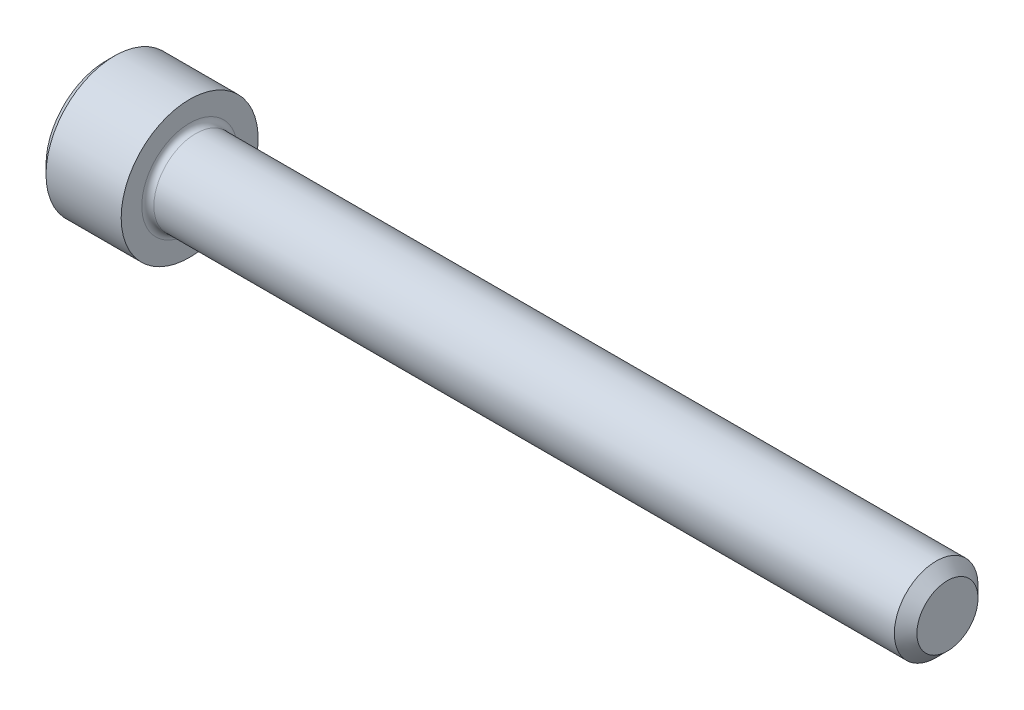
ISO-10303-21;
HEADER;
FILE_DESCRIPTION(('STEP AP214'),'2;1');
FILE_NAME('part.step','',(''),(''),'','','');
FILE_SCHEMA(('AUTOMOTIVE_DESIGN { 1 0 10303 214 1 1 1 1 }'));
ENDSEC;
DATA;
#1=APPLICATION_CONTEXT('core data for automotive mechanical design processes');
#2=APPLICATION_PROTOCOL_DEFINITION('international standard','automotive_design',2000,#1);
#3=PRODUCT_CONTEXT('',#1,'mechanical');
#4=PRODUCT('Part','Part','',(#3));
#5=PRODUCT_RELATED_PRODUCT_CATEGORY('part','',(#4));
#6=PRODUCT_DEFINITION_FORMATION('','',#4);
#7=PRODUCT_DEFINITION_CONTEXT('part definition',#1,'design');
#8=PRODUCT_DEFINITION('design','',#6,#7);
#9=PRODUCT_DEFINITION_SHAPE('','',#8);
#10=(LENGTH_UNIT() NAMED_UNIT(*) SI_UNIT(.MILLI.,.METRE.));
#11=(NAMED_UNIT(*) PLANE_ANGLE_UNIT() SI_UNIT($,.RADIAN.));
#12=(NAMED_UNIT(*) SI_UNIT($,.STERADIAN.) SOLID_ANGLE_UNIT());
#13=UNCERTAINTY_MEASURE_WITH_UNIT(LENGTH_MEASURE(1.E-05),#10,'distance_accuracy_value','');
#14=(GEOMETRIC_REPRESENTATION_CONTEXT(3) GLOBAL_UNCERTAINTY_ASSIGNED_CONTEXT((#13)) GLOBAL_UNIT_ASSIGNED_CONTEXT((#10,
#11,#12)) REPRESENTATION_CONTEXT('',''));
#15=CARTESIAN_POINT('',(0.,0.,0.));
#16=DIRECTION('',(0.,0.,1.));
#17=DIRECTION('',(1.,0.,0.));
#18=AXIS2_PLACEMENT_3D('',#15,#16,#17);
#19=CARTESIAN_POINT('',(0.,0.,0.));
#20=DIRECTION('',(-1.,0.,0.));
#21=DIRECTION('',(0.,0.,1.));
#22=AXIS2_PLACEMENT_3D('',#19,#20,#21);
#23=PLANE('',#22);
#24=DIRECTION('',(0.,-0.499999999999998,0.86602540378444));
#25=VECTOR('',#24,1.);
#26=CARTESIAN_POINT('',(0.,1.5984519552784,0.));
#27=LINE('',#26,#25);
#28=CARTESIAN_POINT('',(0.,1.5984519552784,0.));
#29=VERTEX_POINT('',#28);
#30=CARTESIAN_POINT('',(0.,0.799225977639206,1.3843));
#31=VERTEX_POINT('',#30);
#32=EDGE_CURVE('E264',#29,#31,#27,.T.);
#33=ORIENTED_EDGE('',*,*,#32,.T.);
#34=DIRECTION('',(0.,1.,0.));
#35=VECTOR('',#34,1.);
#36=CARTESIAN_POINT('',(0.,-0.799225977639191,1.3843));
#37=LINE('',#36,#35);
#38=CARTESIAN_POINT('',(0.,-0.799225977639191,1.3843));
#39=VERTEX_POINT('',#38);
#40=EDGE_CURVE('E124',#39,#31,#37,.T.);
#41=ORIENTED_EDGE('',*,*,#40,.F.);
#42=DIRECTION('',(0.,-0.500000000000001,-0.866025403784438));
#43=VECTOR('',#42,1.);
#44=CARTESIAN_POINT('',(0.,-0.799225977639191,1.3843));
#45=LINE('',#44,#43);
#46=CARTESIAN_POINT('',(0.,-1.59845195527839,0.));
#47=VERTEX_POINT('',#46);
#48=EDGE_CURVE('E267',#39,#47,#45,.T.);
#49=ORIENTED_EDGE('',*,*,#48,.T.);
#50=DIRECTION('',(0.,0.499999999999998,-0.86602540378444));
#51=VECTOR('',#50,1.);
#52=CARTESIAN_POINT('',(0.,-1.59845195527839,0.));
#53=LINE('',#52,#51);
#54=CARTESIAN_POINT('',(0.,-0.799225977639196,-1.3843));
#55=VERTEX_POINT('',#54);
#56=EDGE_CURVE('E270',#47,#55,#53,.T.);
#57=ORIENTED_EDGE('',*,*,#56,.T.);
#58=DIRECTION('',(0.,-1.,0.));
#59=VECTOR('',#58,1.);
#60=CARTESIAN_POINT('',(0.,0.799225977639201,-1.3843));
#61=LINE('',#60,#59);
#62=CARTESIAN_POINT('',(0.,0.799225977639201,-1.3843));
#63=VERTEX_POINT('',#62);
#64=EDGE_CURVE('E273',#63,#55,#61,.T.);
#65=ORIENTED_EDGE('',*,*,#64,.F.);
#66=DIRECTION('',(0.,-0.500000000000001,-0.866025403784438));
#67=VECTOR('',#66,1.);
#68=CARTESIAN_POINT('',(0.,1.5984519552784,0.));
#69=LINE('',#68,#67);
#70=EDGE_CURVE('E119',#29,#63,#69,.T.);
#71=ORIENTED_EDGE('',*,*,#70,.F.);
#72=EDGE_LOOP('',(#33,#41,#49,#57,#65,#71));
#73=FACE_BOUND('',#72,.T.);
#74=CARTESIAN_POINT('',(0.,0.,0.));
#75=DIRECTION('',(-1.,0.,0.));
#76=DIRECTION('',(0.,0.,1.));
#77=AXIS2_PLACEMENT_3D('',#74,#75,#76);
#78=CIRCLE('',#77,2.5146);
#79=CARTESIAN_POINT('',(0.,0.,2.5146));
#80=VERTEX_POINT('',#79);
#81=EDGE_CURVE('E148',#80,#80,#78,.T.);
#82=ORIENTED_EDGE('',*,*,#81,.T.);
#83=EDGE_LOOP('',(#82));
#84=FACE_BOUND('',#83,.T.);
#85=ADVANCED_FACE('F32',(#73,#84),#23,.T.);
#86=CARTESIAN_POINT('',(0.,0.,0.));
#87=DIRECTION('',(1.,0.,0.));
#88=DIRECTION('',(0.,0.,-1.));
#89=AXIS2_PLACEMENT_3D('',#86,#87,#88);
#90=CONICAL_SURFACE('',#89,2.5146,0.785398163397457);
#91=CARTESIAN_POINT('',(0.355599999999998,0.,0.));
#92=DIRECTION('',(-1.,0.,0.));
#93=DIRECTION('',(0.,0.,1.));
#94=AXIS2_PLACEMENT_3D('',#91,#92,#93);
#95=CIRCLE('',#94,2.8702);
#96=CARTESIAN_POINT('',(0.355599999999998,0.,2.8702));
#97=VERTEX_POINT('',#96);
#98=EDGE_CURVE('E145',#97,#97,#95,.T.);
#99=ORIENTED_EDGE('',*,*,#98,.T.);
#100=EDGE_LOOP('',(#99));
#101=FACE_BOUND('',#100,.T.);
#102=ORIENTED_EDGE('',*,*,#81,.F.);
#103=EDGE_LOOP('',(#102));
#104=FACE_BOUND('',#103,.T.);
#105=ADVANCED_FACE('F169',(#101,#104),#90,.T.);
#106=CARTESIAN_POINT('',(-31.75,0.,0.));
#107=DIRECTION('',(-1.,0.,0.));
#108=DIRECTION('',(0.,0.,1.));
#109=AXIS2_PLACEMENT_3D('',#106,#107,#108);
#110=CYLINDRICAL_SURFACE('',#109,2.8702);
#111=CARTESIAN_POINT('',(3.5052,0.,0.));
#112=DIRECTION('',(-1.,0.,0.));
#113=DIRECTION('',(0.,0.,1.));
#114=AXIS2_PLACEMENT_3D('',#111,#112,#113);
#115=CIRCLE('',#114,2.8702);
#116=CARTESIAN_POINT('',(3.5052,0.,2.8702));
#117=VERTEX_POINT('',#116);
#118=EDGE_CURVE('E142',#117,#117,#115,.T.);
#119=ORIENTED_EDGE('',*,*,#118,.T.);
#120=EDGE_LOOP('',(#119));
#121=FACE_BOUND('',#120,.T.);
#122=ORIENTED_EDGE('',*,*,#98,.F.);
#123=EDGE_LOOP('',(#122));
#124=FACE_BOUND('',#123,.T.);
#125=ADVANCED_FACE('F174',(#121,#124),#110,.T.);
#126=CARTESIAN_POINT('',(3.5052,2.8702,0.));
#127=DIRECTION('',(1.,0.,0.));
#128=DIRECTION('',(0.,0.,-1.));
#129=AXIS2_PLACEMENT_3D('',#126,#127,#128);
#130=PLANE('',#129);
#131=CARTESIAN_POINT('',(3.5052,0.,0.));
#132=DIRECTION('',(1.,0.,0.));
#133=DIRECTION('',(0.,0.,-1.));
#134=AXIS2_PLACEMENT_3D('',#131,#132,#133);
#135=CIRCLE('',#134,2.00659999999997);
#136=CARTESIAN_POINT('',(3.5052,0.,-2.00659999999997));
#137=VERTEX_POINT('',#136);
#138=EDGE_CURVE('E40',#137,#137,#135,.F.);
#139=ORIENTED_EDGE('',*,*,#138,.T.);
#140=EDGE_LOOP('',(#139));
#141=FACE_BOUND('',#140,.T.);
#142=ORIENTED_EDGE('',*,*,#118,.F.);
#143=EDGE_LOOP('',(#142));
#144=FACE_BOUND('',#143,.T.);
#145=ADVANCED_FACE('F153',(#141,#144),#130,.T.);
#146=CARTESIAN_POINT('',(-31.75,0.,0.));
#147=DIRECTION('',(-1.,0.,0.));
#148=DIRECTION('',(0.,0.,1.));
#149=AXIS2_PLACEMENT_3D('',#146,#147,#148);
#150=CYLINDRICAL_SURFACE('',#149,1.75259999999997);
#151=CARTESIAN_POINT('',(3.7592,0.,0.));
#152=DIRECTION('',(1.,0.,0.));
#153=DIRECTION('',(0.,0.,-1.));
#154=AXIS2_PLACEMENT_3D('',#151,#152,#153);
#155=CIRCLE('',#154,1.75259999999997);
#156=CARTESIAN_POINT('',(3.7592,0.,-1.75259999999997));
#157=VERTEX_POINT('',#156);
#158=EDGE_CURVE('E11',#157,#157,#155,.T.);
#159=ORIENTED_EDGE('',*,*,#158,.T.);
#160=EDGE_LOOP('',(#159));
#161=FACE_BOUND('',#160,.T.);
#162=CARTESIAN_POINT('',(34.78276,0.,0.));
#163=DIRECTION('',(-1.,0.,0.));
#164=DIRECTION('',(0.,0.,1.));
#165=AXIS2_PLACEMENT_3D('',#162,#163,#164);
#166=CIRCLE('',#165,1.75259999999993);
#167=CARTESIAN_POINT('',(34.78276,0.,1.75259999999993));
#168=VERTEX_POINT('',#167);
#169=EDGE_CURVE('E139',#168,#168,#166,.T.);
#170=ORIENTED_EDGE('',*,*,#169,.T.);
#171=EDGE_LOOP('',(#170));
#172=FACE_BOUND('',#171,.T.);
#173=ADVANCED_FACE('F184',(#161,#172),#150,.T.);
#174=CARTESIAN_POINT('',(35.2552,0.,0.));
#175=DIRECTION('',(-1.,0.,0.));
#176=DIRECTION('',(0.,0.,1.));
#177=AXIS2_PLACEMENT_3D('',#174,#175,#176);
#178=CONICAL_SURFACE('',#177,1.28016,0.785398163397326);
#179=ORIENTED_EDGE('',*,*,#169,.F.);
#180=EDGE_LOOP('',(#179));
#181=FACE_BOUND('',#180,.T.);
#182=CARTESIAN_POINT('',(35.2552,0.,0.));
#183=DIRECTION('',(-1.,0.,0.));
#184=DIRECTION('',(0.,0.,1.));
#185=AXIS2_PLACEMENT_3D('',#182,#183,#184);
#186=CIRCLE('',#185,1.28016);
#187=CARTESIAN_POINT('',(35.2552,0.,1.28016));
#188=VERTEX_POINT('',#187);
#189=EDGE_CURVE('E135',#188,#188,#186,.T.);
#190=ORIENTED_EDGE('',*,*,#189,.T.);
#191=EDGE_LOOP('',(#190));
#192=FACE_BOUND('',#191,.T.);
#193=ADVANCED_FACE('F164',(#181,#192),#178,.T.);
#194=CARTESIAN_POINT('',(35.2552,1.28016,0.));
#195=DIRECTION('',(1.,0.,0.));
#196=DIRECTION('',(0.,0.,-1.));
#197=AXIS2_PLACEMENT_3D('',#194,#195,#196);
#198=PLANE('',#197);
#199=ORIENTED_EDGE('',*,*,#189,.F.);
#200=EDGE_LOOP('',(#199));
#201=FACE_BOUND('',#200,.T.);
#202=ADVANCED_FACE('F157',(#201),#198,.T.);
#203=CARTESIAN_POINT('',(3.7592,0.,0.));
#204=DIRECTION('',(1.,0.,0.));
#205=DIRECTION('',(0.,0.,-1.));
#206=AXIS2_PLACEMENT_3D('',#203,#204,#205);
#207=TOROIDAL_SURFACE('',#206,2.00659999999997,0.254);
#208=ORIENTED_EDGE('',*,*,#158,.F.);
#209=EDGE_LOOP('',(#208));
#210=FACE_BOUND('',#209,.T.);
#211=ORIENTED_EDGE('',*,*,#138,.F.);
#212=EDGE_LOOP('',(#211));
#213=FACE_BOUND('',#212,.T.);
#214=ADVANCED_FACE('F34',(#210,#213),#207,.F.);
#215=CARTESIAN_POINT('',(1.6256,1.5984519552784,0.));
#216=DIRECTION('',(0.,-0.86602540378444,-0.499999999999998));
#217=DIRECTION('',(0.,0.499999999999998,-0.86602540378444));
#218=AXIS2_PLACEMENT_3D('',#215,#216,#217);
#219=PLANE('',#218);
#220=ORIENTED_EDGE('',*,*,#32,.F.);
#221=DIRECTION('',(-1.,0.,0.));
#222=VECTOR('',#221,1.);
#223=CARTESIAN_POINT('',(1.6256,1.5984519552784,0.));
#224=LINE('',#223,#222);
#225=CARTESIAN_POINT('',(1.6256,1.5984519552784,0.));
#226=VERTEX_POINT('',#225);
#227=EDGE_CURVE('E263',#226,#29,#224,.T.);
#228=ORIENTED_EDGE('',*,*,#227,.F.);
#229=DIRECTION('',(0.,-0.499999999999998,0.86602540378444));
#230=VECTOR('',#229,1.);
#231=CARTESIAN_POINT('',(1.6256,1.5984519552784,0.));
#232=LINE('',#231,#230);
#233=CARTESIAN_POINT('',(1.6256,1.1988389664588,0.692149999999997));
#234=VERTEX_POINT('',#233);
#235=EDGE_CURVE('E47',#226,#234,#232,.T.);
#236=ORIENTED_EDGE('',*,*,#235,.T.);
#237=CARTESIAN_POINT('',(1.6256,0.799225977639206,1.3843));
#238=VERTEX_POINT('',#237);
#239=EDGE_CURVE('E105',#234,#238,#232,.T.);
#240=ORIENTED_EDGE('',*,*,#239,.T.);
#241=DIRECTION('',(-1.,0.,0.));
#242=VECTOR('',#241,1.);
#243=CARTESIAN_POINT('',(1.6256,0.799225977639206,1.3843));
#244=LINE('',#243,#242);
#245=EDGE_CURVE('E117',#238,#31,#244,.T.);
#246=ORIENTED_EDGE('',*,*,#245,.T.);
#247=EDGE_LOOP('',(#220,#228,#236,#240,#246));
#248=FACE_BOUND('',#247,.T.);
#249=ADVANCED_FACE('F116',(#248),#219,.T.);
#250=CARTESIAN_POINT('',(1.6256,-0.799225977639191,1.3843));
#251=DIRECTION('',(0.,0.,1.));
#252=DIRECTION('',(0.,-1.,0.));
#253=AXIS2_PLACEMENT_3D('',#250,#251,#252);
#254=PLANE('',#253);
#255=ORIENTED_EDGE('',*,*,#40,.T.);
#256=ORIENTED_EDGE('',*,*,#245,.F.);
#257=DIRECTION('',(0.,1.,0.));
#258=VECTOR('',#257,1.);
#259=CARTESIAN_POINT('',(1.6256,-0.799225977639191,1.3843));
#260=LINE('',#259,#258);
#261=CARTESIAN_POINT('',(1.6256,0.,1.3843));
#262=VERTEX_POINT('',#261);
#263=EDGE_CURVE('E103',#262,#238,#260,.T.);
#264=ORIENTED_EDGE('',*,*,#263,.F.);
#265=CARTESIAN_POINT('',(1.6256,-0.799225977639191,1.3843));
#266=VERTEX_POINT('',#265);
#267=EDGE_CURVE('E113',#266,#262,#260,.T.);
#268=ORIENTED_EDGE('',*,*,#267,.F.);
#269=DIRECTION('',(-1.,0.,0.));
#270=VECTOR('',#269,1.);
#271=CARTESIAN_POINT('',(1.6256,-0.799225977639191,1.3843));
#272=LINE('',#271,#270);
#273=EDGE_CURVE('E126',#266,#39,#272,.T.);
#274=ORIENTED_EDGE('',*,*,#273,.T.);
#275=EDGE_LOOP('',(#255,#256,#264,#268,#274));
#276=FACE_BOUND('',#275,.T.);
#277=ADVANCED_FACE('F121',(#276),#254,.F.);
#278=CARTESIAN_POINT('',(1.6256,-0.799225977639191,1.3843));
#279=DIRECTION('',(0.,0.866025403784438,-0.500000000000001));
#280=DIRECTION('',(0.,0.500000000000001,0.866025403784438));
#281=AXIS2_PLACEMENT_3D('',#278,#279,#280);
#282=PLANE('',#281);
#283=ORIENTED_EDGE('',*,*,#48,.F.);
#284=ORIENTED_EDGE('',*,*,#273,.F.);
#285=DIRECTION('',(0.,-0.500000000000001,-0.866025403784438));
#286=VECTOR('',#285,1.);
#287=CARTESIAN_POINT('',(1.6256,-0.799225977639191,1.3843));
#288=LINE('',#287,#286);
#289=CARTESIAN_POINT('',(1.6256,-1.19883896645879,0.692149999999998));
#290=VERTEX_POINT('',#289);
#291=EDGE_CURVE('E244',#266,#290,#288,.T.);
#292=ORIENTED_EDGE('',*,*,#291,.T.);
#293=CARTESIAN_POINT('',(1.6256,-1.59845195527839,0.));
#294=VERTEX_POINT('',#293);
#295=EDGE_CURVE('E246',#290,#294,#288,.T.);
#296=ORIENTED_EDGE('',*,*,#295,.T.);
#297=DIRECTION('',(-1.,0.,0.));
#298=VECTOR('',#297,1.);
#299=CARTESIAN_POINT('',(1.6256,-1.59845195527839,0.));
#300=LINE('',#299,#298);
#301=EDGE_CURVE('E131',#294,#47,#300,.T.);
#302=ORIENTED_EDGE('',*,*,#301,.T.);
#303=EDGE_LOOP('',(#283,#284,#292,#296,#302));
#304=FACE_BOUND('',#303,.T.);
#305=ADVANCED_FACE('F196',(#304),#282,.T.);
#306=CARTESIAN_POINT('',(1.6256,-1.59845195527839,0.));
#307=DIRECTION('',(0.,0.86602540378444,0.499999999999998));
#308=DIRECTION('',(0.,-0.499999999999998,0.86602540378444));
#309=AXIS2_PLACEMENT_3D('',#306,#307,#308);
#310=PLANE('',#309);
#311=ORIENTED_EDGE('',*,*,#56,.F.);
#312=ORIENTED_EDGE('',*,*,#301,.F.);
#313=DIRECTION('',(0.,0.499999999999998,-0.86602540378444));
#314=VECTOR('',#313,1.);
#315=CARTESIAN_POINT('',(1.6256,-1.59845195527839,0.));
#316=LINE('',#315,#314);
#317=CARTESIAN_POINT('',(1.6256,-1.1988389664588,-0.692149999999996));
#318=VERTEX_POINT('',#317);
#319=EDGE_CURVE('E249',#294,#318,#316,.T.);
#320=ORIENTED_EDGE('',*,*,#319,.T.);
#321=CARTESIAN_POINT('',(1.6256,-0.799225977639196,-1.3843));
#322=VERTEX_POINT('',#321);
#323=EDGE_CURVE('E253',#318,#322,#316,.T.);
#324=ORIENTED_EDGE('',*,*,#323,.T.);
#325=DIRECTION('',(-1.,0.,0.));
#326=VECTOR('',#325,1.);
#327=CARTESIAN_POINT('',(1.6256,-0.799225977639196,-1.3843));
#328=LINE('',#327,#326);
#329=EDGE_CURVE('E282',#322,#55,#328,.T.);
#330=ORIENTED_EDGE('',*,*,#329,.T.);
#331=EDGE_LOOP('',(#311,#312,#320,#324,#330));
#332=FACE_BOUND('',#331,.T.);
#333=ADVANCED_FACE('F199',(#332),#310,.T.);
#334=CARTESIAN_POINT('',(1.6256,0.799225977639201,-1.3843));
#335=DIRECTION('',(0.,0.,-1.));
#336=DIRECTION('',(0.,1.,0.));
#337=AXIS2_PLACEMENT_3D('',#334,#335,#336);
#338=PLANE('',#337);
#339=ORIENTED_EDGE('',*,*,#64,.T.);
#340=ORIENTED_EDGE('',*,*,#329,.F.);
#341=DIRECTION('',(0.,-1.,0.));
#342=VECTOR('',#341,1.);
#343=CARTESIAN_POINT('',(1.6256,0.799225977639201,-1.3843));
#344=LINE('',#343,#342);
#345=CARTESIAN_POINT('',(1.6256,0.,-1.3843));
#346=VERTEX_POINT('',#345);
#347=EDGE_CURVE('E257',#346,#322,#344,.T.);
#348=ORIENTED_EDGE('',*,*,#347,.F.);
#349=CARTESIAN_POINT('',(1.6256,0.799225977639201,-1.3843));
#350=VERTEX_POINT('',#349);
#351=EDGE_CURVE('E258',#350,#346,#344,.T.);
#352=ORIENTED_EDGE('',*,*,#351,.F.);
#353=DIRECTION('',(-1.,0.,0.));
#354=VECTOR('',#353,1.);
#355=CARTESIAN_POINT('',(1.6256,0.799225977639201,-1.3843));
#356=LINE('',#355,#354);
#357=EDGE_CURVE('E279',#350,#63,#356,.T.);
#358=ORIENTED_EDGE('',*,*,#357,.T.);
#359=EDGE_LOOP('',(#339,#340,#348,#352,#358));
#360=FACE_BOUND('',#359,.T.);
#361=ADVANCED_FACE('F203',(#360),#338,.F.);
#362=CARTESIAN_POINT('',(1.6256,1.5984519552784,0.));
#363=DIRECTION('',(0.,0.866025403784438,-0.500000000000001));
#364=DIRECTION('',(0.,0.500000000000001,0.866025403784438));
#365=AXIS2_PLACEMENT_3D('',#362,#363,#364);
#366=PLANE('',#365);
#367=ORIENTED_EDGE('',*,*,#70,.T.);
#368=ORIENTED_EDGE('',*,*,#357,.F.);
#369=DIRECTION('',(0.,-0.500000000000001,-0.866025403784438));
#370=VECTOR('',#369,1.);
#371=CARTESIAN_POINT('',(1.6256,1.5984519552784,0.));
#372=LINE('',#371,#370);
#373=CARTESIAN_POINT('',(1.6256,1.1988389664588,-0.692150000000004));
#374=VERTEX_POINT('',#373);
#375=EDGE_CURVE('E261',#374,#350,#372,.T.);
#376=ORIENTED_EDGE('',*,*,#375,.F.);
#377=EDGE_CURVE('E235',#226,#374,#372,.T.);
#378=ORIENTED_EDGE('',*,*,#377,.F.);
#379=ORIENTED_EDGE('',*,*,#227,.T.);
#380=EDGE_LOOP('',(#367,#368,#376,#378,#379));
#381=FACE_BOUND('',#380,.T.);
#382=ADVANCED_FACE('F207',(#381),#366,.F.);
#383=CARTESIAN_POINT('',(1.6256,0.799225977639205,1.3843));
#384=DIRECTION('',(-1.,0.,0.));
#385=DIRECTION('',(0.,0.,1.));
#386=AXIS2_PLACEMENT_3D('',#383,#384,#385);
#387=PLANE('',#386);
#388=CARTESIAN_POINT('',(1.6256,0.,0.));
#389=DIRECTION('',(-1.,0.,0.));
#390=DIRECTION('',(0.,0.,1.));
#391=AXIS2_PLACEMENT_3D('',#388,#389,#390);
#392=CIRCLE('',#391,1.3843);
#393=EDGE_CURVE('E125',#290,#262,#392,.T.);
#394=ORIENTED_EDGE('',*,*,#393,.F.);
#395=ORIENTED_EDGE('',*,*,#291,.F.);
#396=ORIENTED_EDGE('',*,*,#267,.T.);
#397=EDGE_LOOP('',(#394,#395,#396));
#398=FACE_BOUND('',#397,.T.);
#399=ADVANCED_FACE('F211',(#398),#387,.T.);
#400=EDGE_CURVE('E129',#318,#290,#392,.T.);
#401=ORIENTED_EDGE('',*,*,#400,.F.);
#402=ORIENTED_EDGE('',*,*,#319,.F.);
#403=ORIENTED_EDGE('',*,*,#295,.F.);
#404=EDGE_LOOP('',(#401,#402,#403));
#405=FACE_BOUND('',#404,.T.);
#406=ADVANCED_FACE('F214',(#405),#387,.T.);
#407=EDGE_CURVE('E288',#346,#318,#392,.T.);
#408=ORIENTED_EDGE('',*,*,#407,.F.);
#409=ORIENTED_EDGE('',*,*,#347,.T.);
#410=ORIENTED_EDGE('',*,*,#323,.F.);
#411=EDGE_LOOP('',(#408,#409,#410));
#412=FACE_BOUND('',#411,.T.);
#413=ADVANCED_FACE('F219',(#412),#387,.T.);
#414=EDGE_CURVE('E238',#374,#346,#392,.T.);
#415=ORIENTED_EDGE('',*,*,#414,.F.);
#416=ORIENTED_EDGE('',*,*,#375,.T.);
#417=ORIENTED_EDGE('',*,*,#351,.T.);
#418=EDGE_LOOP('',(#415,#416,#417));
#419=FACE_BOUND('',#418,.T.);
#420=ADVANCED_FACE('F226',(#419),#387,.T.);
#421=EDGE_CURVE('E136',#234,#374,#392,.T.);
#422=ORIENTED_EDGE('',*,*,#421,.F.);
#423=ORIENTED_EDGE('',*,*,#235,.F.);
#424=ORIENTED_EDGE('',*,*,#377,.T.);
#425=EDGE_LOOP('',(#422,#423,#424));
#426=FACE_BOUND('',#425,.T.);
#427=ADVANCED_FACE('F222',(#426),#387,.T.);
#428=EDGE_CURVE('E108',#262,#234,#392,.T.);
#429=ORIENTED_EDGE('',*,*,#428,.F.);
#430=ORIENTED_EDGE('',*,*,#263,.T.);
#431=ORIENTED_EDGE('',*,*,#239,.F.);
#432=EDGE_LOOP('',(#429,#430,#431));
#433=FACE_BOUND('',#432,.T.);
#434=ADVANCED_FACE('F104',(#433),#387,.T.);
#435=CARTESIAN_POINT('',(1.6256,0.,0.));
#436=DIRECTION('',(-1.,0.,0.));
#437=DIRECTION('',(0.,0.,1.));
#438=AXIS2_PLACEMENT_3D('',#435,#436,#437);
#439=CONICAL_SURFACE('',#438,1.3843,1.04719755119659);
#440=CARTESIAN_POINT('',(2.4248259776392,0.,0.));
#441=VERTEX_POINT('',#440);
#442=VERTEX_LOOP('',#441);
#443=FACE_BOUND('',#442,.T.);
#444=ORIENTED_EDGE('',*,*,#428,.T.);
#445=ORIENTED_EDGE('',*,*,#421,.T.);
#446=ORIENTED_EDGE('',*,*,#414,.T.);
#447=ORIENTED_EDGE('',*,*,#407,.T.);
#448=ORIENTED_EDGE('',*,*,#400,.T.);
#449=ORIENTED_EDGE('',*,*,#393,.T.);
#450=EDGE_LOOP('',(#444,#445,#446,#447,#448,#449));
#451=FACE_BOUND('',#450,.T.);
#452=ADVANCED_FACE('F191',(#443,#451),#439,.F.);
#453=CLOSED_SHELL('',(#85,#105,#125,#145,#173,#193,#202,#214,#249,#277,#305,#333,#361,#382,#399,
#406,#413,#420,#427,#434,#452));
#454=MANIFOLD_SOLID_BREP('B2',#453);
#455=ADVANCED_BREP_SHAPE_REPRESENTATION('',(#18,#454),#14);
#456=SHAPE_DEFINITION_REPRESENTATION(#9,#455);
ENDSEC;
END-ISO-10303-21;
